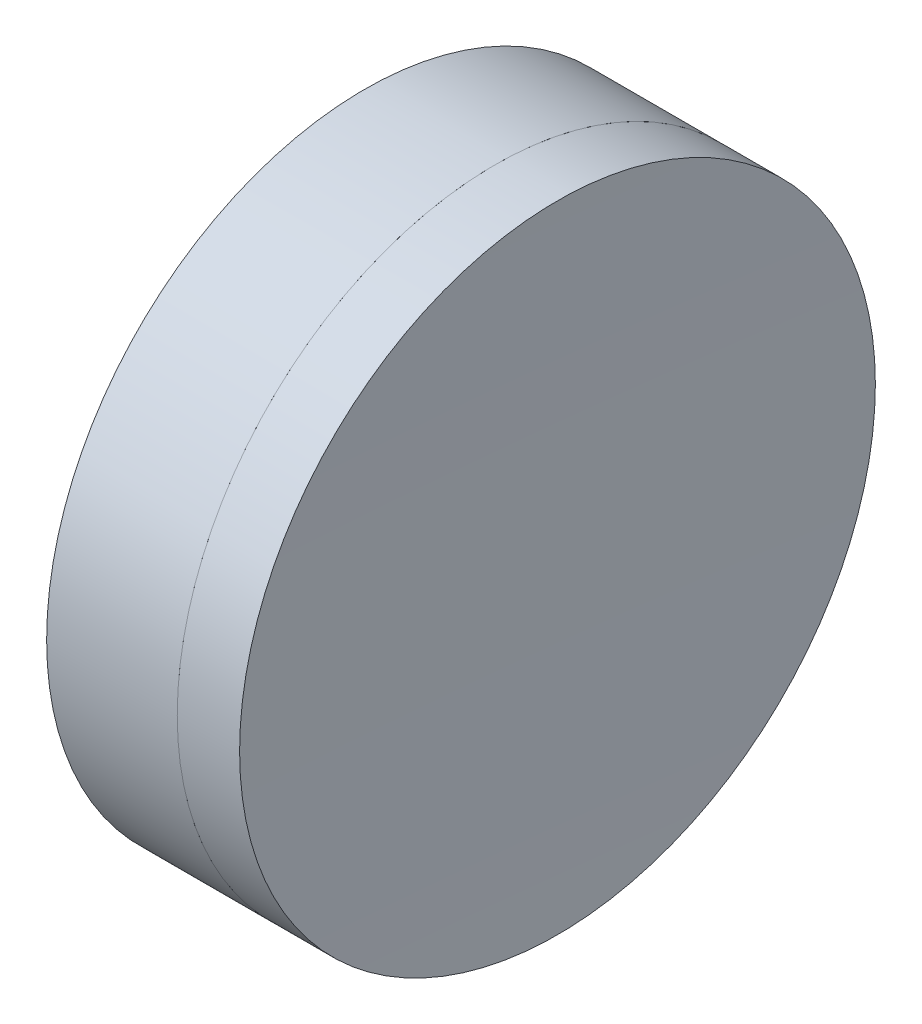
ISO-10303-21;
HEADER;
FILE_DESCRIPTION(('STEP AP214'),'2;1');
FILE_NAME('part.step','',(''),(''),'','','');
FILE_SCHEMA(('AUTOMOTIVE_DESIGN { 1 0 10303 214 1 1 1 1 }'));
ENDSEC;
DATA;
#1=APPLICATION_CONTEXT('core data for automotive mechanical design processes');
#2=APPLICATION_PROTOCOL_DEFINITION('international standard','automotive_design',2000,#1);
#3=PRODUCT_CONTEXT('',#1,'mechanical');
#4=PRODUCT('Part','Part','',(#3));
#5=PRODUCT_RELATED_PRODUCT_CATEGORY('part','',(#4));
#6=PRODUCT_DEFINITION_FORMATION('','',#4);
#7=PRODUCT_DEFINITION_CONTEXT('part definition',#1,'design');
#8=PRODUCT_DEFINITION('design','',#6,#7);
#9=PRODUCT_DEFINITION_SHAPE('','',#8);
#10=(LENGTH_UNIT() NAMED_UNIT(*) SI_UNIT(.MILLI.,.METRE.));
#11=(NAMED_UNIT(*) PLANE_ANGLE_UNIT() SI_UNIT($,.RADIAN.));
#12=(NAMED_UNIT(*) SI_UNIT($,.STERADIAN.) SOLID_ANGLE_UNIT());
#13=UNCERTAINTY_MEASURE_WITH_UNIT(LENGTH_MEASURE(1.E-05),#10,'distance_accuracy_value','');
#14=(GEOMETRIC_REPRESENTATION_CONTEXT(3) GLOBAL_UNCERTAINTY_ASSIGNED_CONTEXT((#13)) GLOBAL_UNIT_ASSIGNED_CONTEXT((#10,
#11,#12)) REPRESENTATION_CONTEXT('',''));
#15=CARTESIAN_POINT('',(0.,0.,0.));
#16=DIRECTION('',(0.,0.,1.));
#17=DIRECTION('',(1.,0.,0.));
#18=AXIS2_PLACEMENT_3D('',#15,#16,#17);
#19=CARTESIAN_POINT('',(305.594650541097,0.,0.));
#20=DIRECTION('',(-1.,0.,0.));
#21=DIRECTION('',(0.,0.,1.));
#22=AXIS2_PLACEMENT_3D('',#19,#20,#21);
#23=SPHERICAL_SURFACE('',#22,49.9000000000002);
#24=CARTESIAN_POINT('',(257.337837550598,0.,0.));
#25=DIRECTION('',(-1.,0.,0.));
#26=DIRECTION('',(0.,0.,1.));
#27=AXIS2_PLACEMENT_3D('',#24,#25,#26);
#28=CIRCLE('',#27,12.7);
#29=CARTESIAN_POINT('',(257.337837550598,0.,12.7));
#30=VERTEX_POINT('',#29);
#31=EDGE_CURVE('E11',#30,#30,#28,.T.);
#32=ORIENTED_EDGE('',*,*,#31,.T.);
#33=EDGE_LOOP('',(#32));
#34=FACE_BOUND('',#33,.T.);
#35=ADVANCED_FACE('F45',(#34),#23,.T.);
#36=CARTESIAN_POINT('',(252.119941814426,0.,0.));
#37=DIRECTION('',(-1.,0.,0.));
#38=DIRECTION('',(0.,0.,1.));
#39=AXIS2_PLACEMENT_3D('',#36,#37,#38);
#40=CYLINDRICAL_SURFACE('',#39,12.7);
#41=CARTESIAN_POINT('',(259.829073932471,0.,0.));
#42=DIRECTION('',(-1.,0.,0.));
#43=DIRECTION('',(0.,0.,1.));
#44=AXIS2_PLACEMENT_3D('',#41,#42,#43);
#45=CIRCLE('',#44,12.7);
#46=CARTESIAN_POINT('',(259.829073932471,0.,12.7));
#47=VERTEX_POINT('',#46);
#48=EDGE_CURVE('E51',#47,#47,#45,.T.);
#49=ORIENTED_EDGE('',*,*,#48,.T.);
#50=EDGE_LOOP('',(#49));
#51=FACE_BOUND('',#50,.T.);
#52=ORIENTED_EDGE('',*,*,#31,.F.);
#53=EDGE_LOOP('',(#52));
#54=FACE_BOUND('',#53,.T.);
#55=ADVANCED_FACE('F57',(#51,#54),#40,.T.);
#56=CARTESIAN_POINT('',(859.694650541097,0.,0.));
#57=DIRECTION('',(-1.,0.,0.));
#58=DIRECTION('',(0.,0.,-1.));
#59=AXIS2_PLACEMENT_3D('',#56,#57,#58);
#60=SPHERICAL_SURFACE('',#59,600.);
#61=ORIENTED_EDGE('',*,*,#48,.F.);
#62=EDGE_LOOP('',(#61));
#63=FACE_BOUND('',#62,.T.);
#64=ADVANCED_FACE('F60',(#63),#60,.F.);
#65=CLOSED_SHELL('',(#35,#55,#64));
#66=MANIFOLD_SOLID_BREP('B2',#65);
#67=CARTESIAN_POINT('',(201.694650541097,0.,0.));
#68=DIRECTION('',(-1.,0.,0.));
#69=DIRECTION('',(0.,0.,1.));
#70=AXIS2_PLACEMENT_3D('',#67,#68,#69);
#71=SPHERICAL_SURFACE('',#70,52.);
#72=CARTESIAN_POINT('',(252.119941814426,0.,0.));
#73=DIRECTION('',(-1.,0.,0.));
#74=DIRECTION('',(0.,0.,1.));
#75=AXIS2_PLACEMENT_3D('',#72,#73,#74);
#76=CIRCLE('',#75,12.7);
#77=CARTESIAN_POINT('',(252.119941814426,0.,12.7));
#78=VERTEX_POINT('',#77);
#79=EDGE_CURVE('E44',#78,#78,#76,.T.);
#80=ORIENTED_EDGE('',*,*,#79,.T.);
#81=EDGE_LOOP('',(#80));
#82=FACE_BOUND('',#81,.T.);
#83=ADVANCED_FACE('F86',(#82),#71,.F.);
#84=CARTESIAN_POINT('',(-0.816062176165804,0.,0.));
#85=DIRECTION('',(-1.,0.,0.));
#86=DIRECTION('',(0.,0.,1.));
#87=AXIS2_PLACEMENT_3D('',#84,#85,#86);
#88=CYLINDRICAL_SURFACE('',#87,12.7);
#89=CARTESIAN_POINT('',(257.337837550598,0.,0.));
#90=DIRECTION('',(-1.,0.,0.));
#91=DIRECTION('',(0.,0.,1.));
#92=AXIS2_PLACEMENT_3D('',#89,#90,#91);
#93=CIRCLE('',#92,12.7);
#94=CARTESIAN_POINT('',(257.337837550598,0.,12.7));
#95=VERTEX_POINT('',#94);
#96=EDGE_CURVE('E92',#95,#95,#93,.T.);
#97=ORIENTED_EDGE('',*,*,#96,.T.);
#98=EDGE_LOOP('',(#97));
#99=FACE_BOUND('',#98,.T.);
#100=ORIENTED_EDGE('',*,*,#79,.F.);
#101=EDGE_LOOP('',(#100));
#102=FACE_BOUND('',#101,.T.);
#103=ADVANCED_FACE('F98',(#99,#102),#88,.T.);
#104=CARTESIAN_POINT('',(305.594650541097,0.,0.));
#105=DIRECTION('',(-1.,0.,0.));
#106=DIRECTION('',(0.,0.,-1.));
#107=AXIS2_PLACEMENT_3D('',#104,#105,#106);
#108=SPHERICAL_SURFACE('',#107,49.9000000000001);
#109=ORIENTED_EDGE('',*,*,#96,.F.);
#110=EDGE_LOOP('',(#109));
#111=FACE_BOUND('',#110,.T.);
#112=ADVANCED_FACE('F101',(#111),#108,.F.);
#113=CLOSED_SHELL('',(#83,#103,#112));
#114=MANIFOLD_SOLID_BREP('B6',#113);
#115=ADVANCED_BREP_SHAPE_REPRESENTATION('',(#18,#66,#114),#14);
#116=SHAPE_DEFINITION_REPRESENTATION(#9,#115);
ENDSEC;
END-ISO-10303-21;
